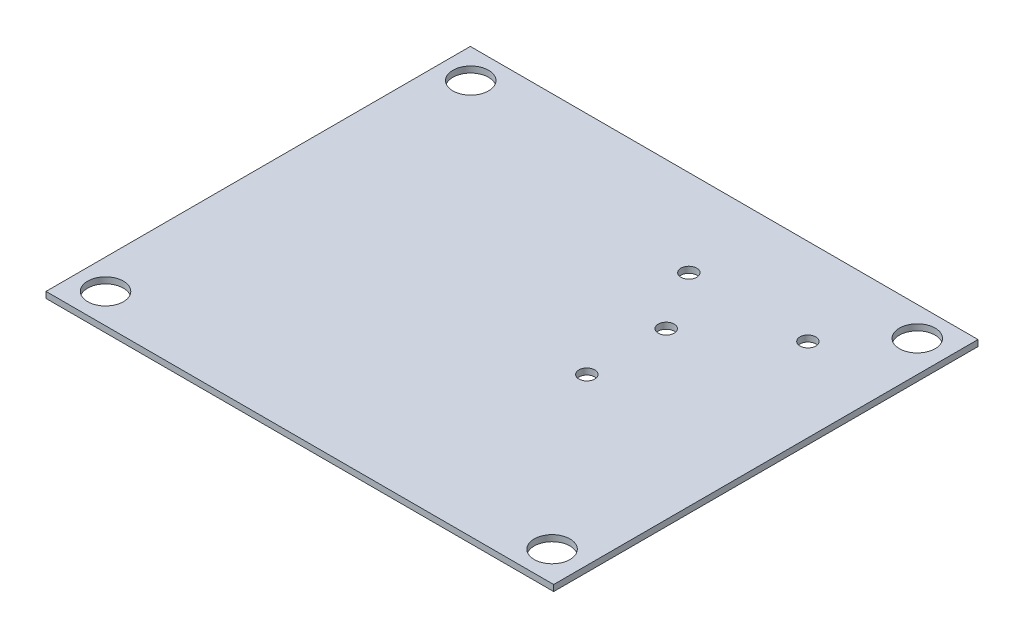
ISO-10303-21;
HEADER;
FILE_DESCRIPTION(('STEP AP214'),'2;1');
FILE_NAME('part.step','',(''),(''),'','','');
FILE_SCHEMA(('AUTOMOTIVE_DESIGN { 1 0 10303 214 1 1 1 1 }'));
ENDSEC;
DATA;
#1=APPLICATION_CONTEXT('core data for automotive mechanical design processes');
#2=APPLICATION_PROTOCOL_DEFINITION('international standard','automotive_design',2000,#1);
#3=PRODUCT_CONTEXT('',#1,'mechanical');
#4=PRODUCT('Part','Part','',(#3));
#5=PRODUCT_RELATED_PRODUCT_CATEGORY('part','',(#4));
#6=PRODUCT_DEFINITION_FORMATION('','',#4);
#7=PRODUCT_DEFINITION_CONTEXT('part definition',#1,'design');
#8=PRODUCT_DEFINITION('design','',#6,#7);
#9=PRODUCT_DEFINITION_SHAPE('','',#8);
#10=(LENGTH_UNIT() NAMED_UNIT(*) SI_UNIT(.MILLI.,.METRE.));
#11=(NAMED_UNIT(*) PLANE_ANGLE_UNIT() SI_UNIT($,.RADIAN.));
#12=(NAMED_UNIT(*) SI_UNIT($,.STERADIAN.) SOLID_ANGLE_UNIT());
#13=UNCERTAINTY_MEASURE_WITH_UNIT(LENGTH_MEASURE(1.E-05),#10,'distance_accuracy_value','');
#14=(GEOMETRIC_REPRESENTATION_CONTEXT(3) GLOBAL_UNCERTAINTY_ASSIGNED_CONTEXT((#13)) GLOBAL_UNIT_ASSIGNED_CONTEXT((#10,
#11,#12)) REPRESENTATION_CONTEXT('',''));
#15=CARTESIAN_POINT('',(0.,0.,0.));
#16=DIRECTION('',(0.,0.,1.));
#17=DIRECTION('',(1.,0.,0.));
#18=AXIS2_PLACEMENT_3D('',#15,#16,#17);
#19=CARTESIAN_POINT('',(0.,0.7874,0.));
#20=DIRECTION('',(0.,1.,0.));
#21=DIRECTION('',(0.,0.,1.));
#22=AXIS2_PLACEMENT_3D('',#19,#20,#21);
#23=PLANE('',#22);
#24=CARTESIAN_POINT('',(11.3284,0.7874,-8.40740000000001));
#25=DIRECTION('',(0.,1.,0.));
#26=DIRECTION('',(0.,0.,1.));
#27=AXIS2_PLACEMENT_3D('',#24,#25,#26);
#28=CIRCLE('',#27,1.016);
#29=CARTESIAN_POINT('',(11.3284,0.7874,-7.39140000000001));
#30=VERTEX_POINT('',#29);
#31=EDGE_CURVE('E146',#30,#30,#28,.T.);
#32=ORIENTED_EDGE('',*,*,#31,.F.);
#33=EDGE_LOOP('',(#32));
#34=FACE_BOUND('',#33,.T.);
#35=CARTESIAN_POINT('',(-28.6766000000002,0.7874,-23.3934));
#36=DIRECTION('',(0.,1.,0.));
#37=DIRECTION('',(0.,0.,1.));
#38=AXIS2_PLACEMENT_3D('',#35,#36,#37);
#39=CIRCLE('',#38,2.286);
#40=CARTESIAN_POINT('',(-28.6766000000002,0.7874,-21.1074));
#41=VERTEX_POINT('',#40);
#42=EDGE_CURVE('E134',#41,#41,#39,.T.);
#43=ORIENTED_EDGE('',*,*,#42,.F.);
#44=EDGE_LOOP('',(#43));
#45=FACE_BOUND('',#44,.T.);
#46=CARTESIAN_POINT('',(28.4734,0.7874,23.3426));
#47=DIRECTION('',(0.,1.,0.));
#48=DIRECTION('',(0.,0.,1.));
#49=AXIS2_PLACEMENT_3D('',#46,#47,#48);
#50=CIRCLE('',#49,2.286);
#51=CARTESIAN_POINT('',(28.4734,0.7874,25.6286));
#52=VERTEX_POINT('',#51);
#53=EDGE_CURVE('E122',#52,#52,#50,.T.);
#54=ORIENTED_EDGE('',*,*,#53,.F.);
#55=EDGE_LOOP('',(#54));
#56=FACE_BOUND('',#55,.T.);
#57=CARTESIAN_POINT('',(11.3284,0.7874,1.75259999999999));
#58=DIRECTION('',(0.,1.,0.));
#59=DIRECTION('',(0.,0.,1.));
#60=AXIS2_PLACEMENT_3D('',#57,#58,#59);
#61=CIRCLE('',#60,1.016);
#62=CARTESIAN_POINT('',(11.3284,0.7874,2.76859999999999));
#63=VERTEX_POINT('',#62);
#64=EDGE_CURVE('E101',#63,#63,#61,.T.);
#65=ORIENTED_EDGE('',*,*,#64,.F.);
#66=EDGE_LOOP('',(#65));
#67=FACE_BOUND('',#66,.T.);
#68=DIRECTION('',(0.,0.,1.));
#69=VECTOR('',#68,1.);
#70=CARTESIAN_POINT('',(-32.4866,0.7874,27.1526));
#71=LINE('',#70,#69);
#72=CARTESIAN_POINT('',(-32.4866,0.7874,-27.1526));
#73=VERTEX_POINT('',#72);
#74=CARTESIAN_POINT('',(-32.4866,0.7874,27.1526));
#75=VERTEX_POINT('',#74);
#76=EDGE_CURVE('E86',#73,#75,#71,.T.);
#77=ORIENTED_EDGE('',*,*,#76,.T.);
#78=DIRECTION('',(1.,0.,0.));
#79=VECTOR('',#78,1.);
#80=CARTESIAN_POINT('',(32.4866,0.7874,27.1526));
#81=LINE('',#80,#79);
#82=CARTESIAN_POINT('',(32.4866,0.7874,27.1526));
#83=VERTEX_POINT('',#82);
#84=EDGE_CURVE('E81',#75,#83,#81,.T.);
#85=ORIENTED_EDGE('',*,*,#84,.T.);
#86=DIRECTION('',(0.,0.,-1.));
#87=VECTOR('',#86,1.);
#88=CARTESIAN_POINT('',(32.4866,0.7874,27.1526));
#89=LINE('',#88,#87);
#90=CARTESIAN_POINT('',(32.4866,0.7874,-27.1526));
#91=VERTEX_POINT('',#90);
#92=EDGE_CURVE('E84',#83,#91,#89,.T.);
#93=ORIENTED_EDGE('',*,*,#92,.T.);
#94=DIRECTION('',(-1.,0.,0.));
#95=VECTOR('',#94,1.);
#96=CARTESIAN_POINT('',(32.4866,0.7874,-27.1526));
#97=LINE('',#96,#95);
#98=EDGE_CURVE('E51',#91,#73,#97,.T.);
#99=ORIENTED_EDGE('',*,*,#98,.T.);
#100=EDGE_LOOP('',(#77,#85,#93,#99));
#101=FACE_BOUND('',#100,.T.);
#102=CARTESIAN_POINT('',(-28.6766,0.7874,23.3426));
#103=DIRECTION('',(0.,1.,0.));
#104=DIRECTION('',(0.,0.,1.));
#105=AXIS2_PLACEMENT_3D('',#102,#103,#104);
#106=CIRCLE('',#105,2.286);
#107=CARTESIAN_POINT('',(-28.6766,0.7874,25.6286));
#108=VERTEX_POINT('',#107);
#109=EDGE_CURVE('E116',#108,#108,#106,.T.);
#110=ORIENTED_EDGE('',*,*,#109,.F.);
#111=EDGE_LOOP('',(#110));
#112=FACE_BOUND('',#111,.T.);
#113=CARTESIAN_POINT('',(28.4733999999998,0.7874,-23.3934));
#114=DIRECTION('',(0.,1.,0.));
#115=DIRECTION('',(0.,0.,1.));
#116=AXIS2_PLACEMENT_3D('',#113,#114,#115);
#117=CIRCLE('',#116,2.286);
#118=CARTESIAN_POINT('',(28.4733999999998,0.7874,-21.1074));
#119=VERTEX_POINT('',#118);
#120=EDGE_CURVE('E128',#119,#119,#117,.T.);
#121=ORIENTED_EDGE('',*,*,#120,.F.);
#122=EDGE_LOOP('',(#121));
#123=FACE_BOUND('',#122,.T.);
#124=CARTESIAN_POINT('',(6.57859999999998,0.7874,-16.0528));
#125=DIRECTION('',(0.,1.,0.));
#126=DIRECTION('',(0.,0.,1.));
#127=AXIS2_PLACEMENT_3D('',#124,#125,#126);
#128=CIRCLE('',#127,1.016);
#129=CARTESIAN_POINT('',(6.57859999999998,0.7874,-15.0368));
#130=VERTEX_POINT('',#129);
#131=EDGE_CURVE('E140',#130,#130,#128,.T.);
#132=ORIENTED_EDGE('',*,*,#131,.F.);
#133=EDGE_LOOP('',(#132));
#134=FACE_BOUND('',#133,.T.);
#135=CARTESIAN_POINT('',(21.8186,0.7874,-16.0528));
#136=DIRECTION('',(0.,1.,0.));
#137=DIRECTION('',(0.,0.,1.));
#138=AXIS2_PLACEMENT_3D('',#135,#136,#137);
#139=CIRCLE('',#138,1.016);
#140=CARTESIAN_POINT('',(21.8186,0.7874,-15.0368));
#141=VERTEX_POINT('',#140);
#142=EDGE_CURVE('E152',#141,#141,#139,.T.);
#143=ORIENTED_EDGE('',*,*,#142,.F.);
#144=EDGE_LOOP('',(#143));
#145=FACE_BOUND('',#144,.T.);
#146=ADVANCED_FACE('F34',(#34,#45,#56,#67,#101,#112,#123,#134,#145),#23,.T.);
#147=CARTESIAN_POINT('',(0.,0.,0.));
#148=DIRECTION('',(0.,1.,0.));
#149=DIRECTION('',(0.,0.,1.));
#150=AXIS2_PLACEMENT_3D('',#147,#148,#149);
#151=PLANE('',#150);
#152=DIRECTION('',(0.,0.,1.));
#153=VECTOR('',#152,1.);
#154=CARTESIAN_POINT('',(-32.4866,0.,27.1526));
#155=LINE('',#154,#153);
#156=CARTESIAN_POINT('',(-32.4866,0.,-27.1526));
#157=VERTEX_POINT('',#156);
#158=CARTESIAN_POINT('',(-32.4866,0.,27.1526));
#159=VERTEX_POINT('',#158);
#160=EDGE_CURVE('E98',#157,#159,#155,.T.);
#161=ORIENTED_EDGE('',*,*,#160,.F.);
#162=DIRECTION('',(-1.,0.,0.));
#163=VECTOR('',#162,1.);
#164=CARTESIAN_POINT('',(32.4866,0.,-27.1526));
#165=LINE('',#164,#163);
#166=CARTESIAN_POINT('',(32.4866,0.,-27.1526));
#167=VERTEX_POINT('',#166);
#168=EDGE_CURVE('E74',#167,#157,#165,.T.);
#169=ORIENTED_EDGE('',*,*,#168,.F.);
#170=DIRECTION('',(0.,0.,-1.));
#171=VECTOR('',#170,1.);
#172=CARTESIAN_POINT('',(32.4866,0.,27.1526));
#173=LINE('',#172,#171);
#174=CARTESIAN_POINT('',(32.4866,0.,27.1526));
#175=VERTEX_POINT('',#174);
#176=EDGE_CURVE('E68',#175,#167,#173,.T.);
#177=ORIENTED_EDGE('',*,*,#176,.F.);
#178=DIRECTION('',(1.,0.,0.));
#179=VECTOR('',#178,1.);
#180=CARTESIAN_POINT('',(32.4866,0.,27.1526));
#181=LINE('',#180,#179);
#182=EDGE_CURVE('E90',#159,#175,#181,.T.);
#183=ORIENTED_EDGE('',*,*,#182,.F.);
#184=EDGE_LOOP('',(#161,#169,#177,#183));
#185=FACE_BOUND('',#184,.T.);
#186=CARTESIAN_POINT('',(11.3284,0.,1.75259999999999));
#187=DIRECTION('',(0.,1.,0.));
#188=DIRECTION('',(0.,0.,1.));
#189=AXIS2_PLACEMENT_3D('',#186,#187,#188);
#190=CIRCLE('',#189,1.016);
#191=CARTESIAN_POINT('',(11.3284,0.,2.76859999999999));
#192=VERTEX_POINT('',#191);
#193=EDGE_CURVE('E113',#192,#192,#190,.T.);
#194=ORIENTED_EDGE('',*,*,#193,.T.);
#195=EDGE_LOOP('',(#194));
#196=FACE_BOUND('',#195,.T.);
#197=CARTESIAN_POINT('',(-28.6766,0.,23.3426));
#198=DIRECTION('',(0.,1.,0.));
#199=DIRECTION('',(0.,0.,1.));
#200=AXIS2_PLACEMENT_3D('',#197,#198,#199);
#201=CIRCLE('',#200,2.286);
#202=CARTESIAN_POINT('',(-28.6766,0.,25.6286));
#203=VERTEX_POINT('',#202);
#204=EDGE_CURVE('E119',#203,#203,#201,.T.);
#205=ORIENTED_EDGE('',*,*,#204,.T.);
#206=EDGE_LOOP('',(#205));
#207=FACE_BOUND('',#206,.T.);
#208=CARTESIAN_POINT('',(28.4734,0.,23.3426));
#209=DIRECTION('',(0.,1.,0.));
#210=DIRECTION('',(0.,0.,1.));
#211=AXIS2_PLACEMENT_3D('',#208,#209,#210);
#212=CIRCLE('',#211,2.286);
#213=CARTESIAN_POINT('',(28.4734,0.,25.6286));
#214=VERTEX_POINT('',#213);
#215=EDGE_CURVE('E125',#214,#214,#212,.T.);
#216=ORIENTED_EDGE('',*,*,#215,.T.);
#217=EDGE_LOOP('',(#216));
#218=FACE_BOUND('',#217,.T.);
#219=CARTESIAN_POINT('',(28.4733999999998,0.,-23.3934));
#220=DIRECTION('',(0.,1.,0.));
#221=DIRECTION('',(0.,0.,1.));
#222=AXIS2_PLACEMENT_3D('',#219,#220,#221);
#223=CIRCLE('',#222,2.286);
#224=CARTESIAN_POINT('',(28.4733999999998,0.,-21.1074));
#225=VERTEX_POINT('',#224);
#226=EDGE_CURVE('E131',#225,#225,#223,.T.);
#227=ORIENTED_EDGE('',*,*,#226,.T.);
#228=EDGE_LOOP('',(#227));
#229=FACE_BOUND('',#228,.T.);
#230=CARTESIAN_POINT('',(-28.6766000000002,0.,-23.3934));
#231=DIRECTION('',(0.,1.,0.));
#232=DIRECTION('',(0.,0.,1.));
#233=AXIS2_PLACEMENT_3D('',#230,#231,#232);
#234=CIRCLE('',#233,2.286);
#235=CARTESIAN_POINT('',(-28.6766000000002,0.,-21.1074));
#236=VERTEX_POINT('',#235);
#237=EDGE_CURVE('E137',#236,#236,#234,.T.);
#238=ORIENTED_EDGE('',*,*,#237,.T.);
#239=EDGE_LOOP('',(#238));
#240=FACE_BOUND('',#239,.T.);
#241=CARTESIAN_POINT('',(6.57859999999998,0.,-16.0528));
#242=DIRECTION('',(0.,1.,0.));
#243=DIRECTION('',(0.,0.,1.));
#244=AXIS2_PLACEMENT_3D('',#241,#242,#243);
#245=CIRCLE('',#244,1.016);
#246=CARTESIAN_POINT('',(6.57859999999998,0.,-15.0368));
#247=VERTEX_POINT('',#246);
#248=EDGE_CURVE('E143',#247,#247,#245,.T.);
#249=ORIENTED_EDGE('',*,*,#248,.T.);
#250=EDGE_LOOP('',(#249));
#251=FACE_BOUND('',#250,.T.);
#252=CARTESIAN_POINT('',(11.3284,0.,-8.40740000000001));
#253=DIRECTION('',(0.,1.,0.));
#254=DIRECTION('',(0.,0.,1.));
#255=AXIS2_PLACEMENT_3D('',#252,#253,#254);
#256=CIRCLE('',#255,1.016);
#257=CARTESIAN_POINT('',(11.3284,0.,-7.39140000000001));
#258=VERTEX_POINT('',#257);
#259=EDGE_CURVE('E149',#258,#258,#256,.T.);
#260=ORIENTED_EDGE('',*,*,#259,.T.);
#261=EDGE_LOOP('',(#260));
#262=FACE_BOUND('',#261,.T.);
#263=CARTESIAN_POINT('',(21.8186,0.,-16.0528));
#264=DIRECTION('',(0.,1.,0.));
#265=DIRECTION('',(0.,0.,1.));
#266=AXIS2_PLACEMENT_3D('',#263,#264,#265);
#267=CIRCLE('',#266,1.016);
#268=CARTESIAN_POINT('',(21.8186,0.,-15.0368));
#269=VERTEX_POINT('',#268);
#270=EDGE_CURVE('E155',#269,#269,#267,.T.);
#271=ORIENTED_EDGE('',*,*,#270,.T.);
#272=EDGE_LOOP('',(#271));
#273=FACE_BOUND('',#272,.T.);
#274=ADVANCED_FACE('F109',(#185,#196,#207,#218,#229,#240,#251,#262,#273),#151,.F.);
#275=CARTESIAN_POINT('',(-32.4866,0.7874,27.1526));
#276=DIRECTION('',(1.,0.,0.));
#277=DIRECTION('',(0.,0.,-1.));
#278=AXIS2_PLACEMENT_3D('',#275,#276,#277);
#279=PLANE('',#278);
#280=ORIENTED_EDGE('',*,*,#160,.T.);
#281=DIRECTION('',(0.,-1.,0.));
#282=VECTOR('',#281,1.);
#283=CARTESIAN_POINT('',(-32.4866,0.7874,27.1526));
#284=LINE('',#283,#282);
#285=EDGE_CURVE('E11',#75,#159,#284,.T.);
#286=ORIENTED_EDGE('',*,*,#285,.F.);
#287=ORIENTED_EDGE('',*,*,#76,.F.);
#288=DIRECTION('',(0.,-1.,0.));
#289=VECTOR('',#288,1.);
#290=CARTESIAN_POINT('',(-32.4866,0.7874,-27.1526));
#291=LINE('',#290,#289);
#292=EDGE_CURVE('E94',#73,#157,#291,.T.);
#293=ORIENTED_EDGE('',*,*,#292,.T.);
#294=EDGE_LOOP('',(#280,#286,#287,#293));
#295=FACE_BOUND('',#294,.T.);
#296=ADVANCED_FACE('F36',(#295),#279,.F.);
#297=CARTESIAN_POINT('',(32.4866,0.7874,27.1526));
#298=DIRECTION('',(0.,0.,-1.));
#299=DIRECTION('',(-1.,0.,0.));
#300=AXIS2_PLACEMENT_3D('',#297,#298,#299);
#301=PLANE('',#300);
#302=ORIENTED_EDGE('',*,*,#182,.T.);
#303=DIRECTION('',(0.,-1.,0.));
#304=VECTOR('',#303,1.);
#305=CARTESIAN_POINT('',(32.4866,0.7874,27.1526));
#306=LINE('',#305,#304);
#307=EDGE_CURVE('E43',#83,#175,#306,.T.);
#308=ORIENTED_EDGE('',*,*,#307,.F.);
#309=ORIENTED_EDGE('',*,*,#84,.F.);
#310=ORIENTED_EDGE('',*,*,#285,.T.);
#311=EDGE_LOOP('',(#302,#308,#309,#310));
#312=FACE_BOUND('',#311,.T.);
#313=ADVANCED_FACE('F89',(#312),#301,.F.);
#314=CARTESIAN_POINT('',(32.4866,0.7874,27.1526));
#315=DIRECTION('',(-1.,0.,0.));
#316=DIRECTION('',(0.,0.,1.));
#317=AXIS2_PLACEMENT_3D('',#314,#315,#316);
#318=PLANE('',#317);
#319=ORIENTED_EDGE('',*,*,#176,.T.);
#320=DIRECTION('',(0.,-1.,0.));
#321=VECTOR('',#320,1.);
#322=CARTESIAN_POINT('',(32.4866,0.7874,-27.1526));
#323=LINE('',#322,#321);
#324=EDGE_CURVE('E91',#91,#167,#323,.T.);
#325=ORIENTED_EDGE('',*,*,#324,.F.);
#326=ORIENTED_EDGE('',*,*,#92,.F.);
#327=ORIENTED_EDGE('',*,*,#307,.T.);
#328=EDGE_LOOP('',(#319,#325,#326,#327));
#329=FACE_BOUND('',#328,.T.);
#330=ADVANCED_FACE('F92',(#329),#318,.F.);
#331=CARTESIAN_POINT('',(32.4866,0.7874,-27.1526));
#332=DIRECTION('',(0.,0.,1.));
#333=DIRECTION('',(1.,0.,0.));
#334=AXIS2_PLACEMENT_3D('',#331,#332,#333);
#335=PLANE('',#334);
#336=ORIENTED_EDGE('',*,*,#168,.T.);
#337=ORIENTED_EDGE('',*,*,#292,.F.);
#338=ORIENTED_EDGE('',*,*,#98,.F.);
#339=ORIENTED_EDGE('',*,*,#324,.T.);
#340=EDGE_LOOP('',(#336,#337,#338,#339));
#341=FACE_BOUND('',#340,.T.);
#342=ADVANCED_FACE('F106',(#341),#335,.F.);
#343=CARTESIAN_POINT('',(11.3284,0.7874,1.75259999999999));
#344=DIRECTION('',(0.,-1.,0.));
#345=DIRECTION('',(0.,0.,-1.));
#346=AXIS2_PLACEMENT_3D('',#343,#344,#345);
#347=CYLINDRICAL_SURFACE('',#346,1.016);
#348=ORIENTED_EDGE('',*,*,#64,.T.);
#349=EDGE_LOOP('',(#348));
#350=FACE_BOUND('',#349,.T.);
#351=ORIENTED_EDGE('',*,*,#193,.F.);
#352=EDGE_LOOP('',(#351));
#353=FACE_BOUND('',#352,.T.);
#354=ADVANCED_FACE('F174',(#350,#353),#347,.F.);
#355=CARTESIAN_POINT('',(-28.6766,0.7874,23.3426));
#356=DIRECTION('',(0.,-1.,0.));
#357=DIRECTION('',(0.,0.,-1.));
#358=AXIS2_PLACEMENT_3D('',#355,#356,#357);
#359=CYLINDRICAL_SURFACE('',#358,2.286);
#360=ORIENTED_EDGE('',*,*,#109,.T.);
#361=EDGE_LOOP('',(#360));
#362=FACE_BOUND('',#361,.T.);
#363=ORIENTED_EDGE('',*,*,#204,.F.);
#364=EDGE_LOOP('',(#363));
#365=FACE_BOUND('',#364,.T.);
#366=ADVANCED_FACE('F220',(#362,#365),#359,.F.);
#367=CARTESIAN_POINT('',(28.4734,0.7874,23.3426));
#368=DIRECTION('',(0.,-1.,0.));
#369=DIRECTION('',(0.,0.,-1.));
#370=AXIS2_PLACEMENT_3D('',#367,#368,#369);
#371=CYLINDRICAL_SURFACE('',#370,2.286);
#372=ORIENTED_EDGE('',*,*,#53,.T.);
#373=EDGE_LOOP('',(#372));
#374=FACE_BOUND('',#373,.T.);
#375=ORIENTED_EDGE('',*,*,#215,.F.);
#376=EDGE_LOOP('',(#375));
#377=FACE_BOUND('',#376,.T.);
#378=ADVANCED_FACE('F228',(#374,#377),#371,.F.);
#379=CARTESIAN_POINT('',(28.4733999999998,0.7874,-23.3934));
#380=DIRECTION('',(0.,-1.,0.));
#381=DIRECTION('',(0.,0.,-1.));
#382=AXIS2_PLACEMENT_3D('',#379,#380,#381);
#383=CYLINDRICAL_SURFACE('',#382,2.286);
#384=ORIENTED_EDGE('',*,*,#120,.T.);
#385=EDGE_LOOP('',(#384));
#386=FACE_BOUND('',#385,.T.);
#387=ORIENTED_EDGE('',*,*,#226,.F.);
#388=EDGE_LOOP('',(#387));
#389=FACE_BOUND('',#388,.T.);
#390=ADVANCED_FACE('F236',(#386,#389),#383,.F.);
#391=CARTESIAN_POINT('',(-28.6766000000002,0.7874,-23.3934));
#392=DIRECTION('',(0.,-1.,0.));
#393=DIRECTION('',(0.,0.,-1.));
#394=AXIS2_PLACEMENT_3D('',#391,#392,#393);
#395=CYLINDRICAL_SURFACE('',#394,2.286);
#396=ORIENTED_EDGE('',*,*,#42,.T.);
#397=EDGE_LOOP('',(#396));
#398=FACE_BOUND('',#397,.T.);
#399=ORIENTED_EDGE('',*,*,#237,.F.);
#400=EDGE_LOOP('',(#399));
#401=FACE_BOUND('',#400,.T.);
#402=ADVANCED_FACE('F245',(#398,#401),#395,.F.);
#403=CARTESIAN_POINT('',(6.57859999999998,0.7874,-16.0528));
#404=DIRECTION('',(0.,-1.,0.));
#405=DIRECTION('',(0.,0.,-1.));
#406=AXIS2_PLACEMENT_3D('',#403,#404,#405);
#407=CYLINDRICAL_SURFACE('',#406,1.016);
#408=ORIENTED_EDGE('',*,*,#131,.T.);
#409=EDGE_LOOP('',(#408));
#410=FACE_BOUND('',#409,.T.);
#411=ORIENTED_EDGE('',*,*,#248,.F.);
#412=EDGE_LOOP('',(#411));
#413=FACE_BOUND('',#412,.T.);
#414=ADVANCED_FACE('F254',(#410,#413),#407,.F.);
#415=CARTESIAN_POINT('',(11.3284,0.7874,-8.40740000000001));
#416=DIRECTION('',(0.,-1.,0.));
#417=DIRECTION('',(0.,0.,-1.));
#418=AXIS2_PLACEMENT_3D('',#415,#416,#417);
#419=CYLINDRICAL_SURFACE('',#418,1.016);
#420=ORIENTED_EDGE('',*,*,#31,.T.);
#421=EDGE_LOOP('',(#420));
#422=FACE_BOUND('',#421,.T.);
#423=ORIENTED_EDGE('',*,*,#259,.F.);
#424=EDGE_LOOP('',(#423));
#425=FACE_BOUND('',#424,.T.);
#426=ADVANCED_FACE('F263',(#422,#425),#419,.F.);
#427=CARTESIAN_POINT('',(21.8186,0.7874,-16.0528));
#428=DIRECTION('',(0.,-1.,0.));
#429=DIRECTION('',(0.,0.,-1.));
#430=AXIS2_PLACEMENT_3D('',#427,#428,#429);
#431=CYLINDRICAL_SURFACE('',#430,1.016);
#432=ORIENTED_EDGE('',*,*,#142,.T.);
#433=EDGE_LOOP('',(#432));
#434=FACE_BOUND('',#433,.T.);
#435=ORIENTED_EDGE('',*,*,#270,.F.);
#436=EDGE_LOOP('',(#435));
#437=FACE_BOUND('',#436,.T.);
#438=ADVANCED_FACE('F161',(#434,#437),#431,.F.);
#439=CLOSED_SHELL('',(#146,#274,#296,#313,#330,#342,#354,#366,#378,#390,#402,#414,#426,#438));
#440=MANIFOLD_SOLID_BREP('B2',#439);
#441=ADVANCED_BREP_SHAPE_REPRESENTATION('',(#18,#440),#14);
#442=SHAPE_DEFINITION_REPRESENTATION(#9,#441);
ENDSEC;
END-ISO-10303-21;
